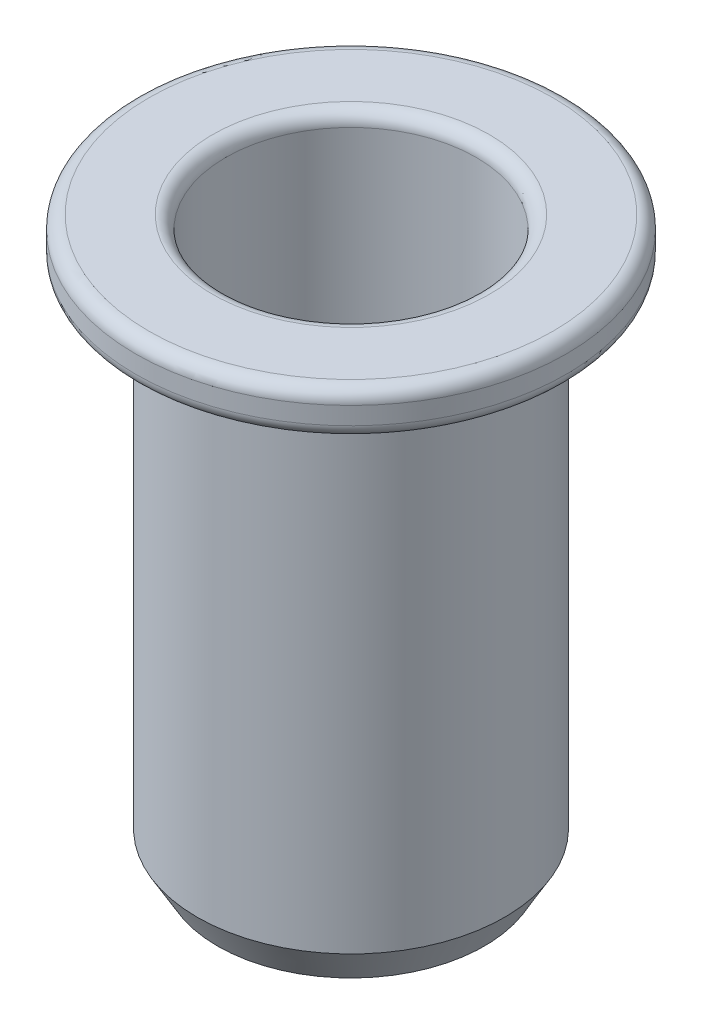
ISO-10303-21;
HEADER;
FILE_DESCRIPTION(('STEP AP214'),'2;1');
FILE_NAME('part.step','',(''),(''),'','','');
FILE_SCHEMA(('AUTOMOTIVE_DESIGN { 1 0 10303 214 1 1 1 1 }'));
ENDSEC;
DATA;
#1=APPLICATION_CONTEXT('core data for automotive mechanical design processes');
#2=APPLICATION_PROTOCOL_DEFINITION('international standard','automotive_design',2000,#1);
#3=PRODUCT_CONTEXT('',#1,'mechanical');
#4=PRODUCT('Part','Part','',(#3));
#5=PRODUCT_RELATED_PRODUCT_CATEGORY('part','',(#4));
#6=PRODUCT_DEFINITION_FORMATION('','',#4);
#7=PRODUCT_DEFINITION_CONTEXT('part definition',#1,'design');
#8=PRODUCT_DEFINITION('design','',#6,#7);
#9=PRODUCT_DEFINITION_SHAPE('','',#8);
#10=(LENGTH_UNIT() NAMED_UNIT(*) SI_UNIT(.MILLI.,.METRE.));
#11=(NAMED_UNIT(*) PLANE_ANGLE_UNIT() SI_UNIT($,.RADIAN.));
#12=(NAMED_UNIT(*) SI_UNIT($,.STERADIAN.) SOLID_ANGLE_UNIT());
#13=UNCERTAINTY_MEASURE_WITH_UNIT(LENGTH_MEASURE(1.E-05),#10,'distance_accuracy_value','');
#14=(GEOMETRIC_REPRESENTATION_CONTEXT(3) GLOBAL_UNCERTAINTY_ASSIGNED_CONTEXT((#13)) GLOBAL_UNIT_ASSIGNED_CONTEXT((#10,
#11,#12)) REPRESENTATION_CONTEXT('',''));
#15=CARTESIAN_POINT('',(0.,0.,0.));
#16=DIRECTION('',(0.,0.,1.));
#17=DIRECTION('',(1.,0.,0.));
#18=AXIS2_PLACEMENT_3D('',#15,#16,#17);
#19=CARTESIAN_POINT('',(0.,0.,0.));
#20=DIRECTION('',(0.,1.,0.));
#21=DIRECTION('',(0.,0.,1.));
#22=AXIS2_PLACEMENT_3D('',#19,#20,#21);
#23=CYLINDRICAL_SURFACE('',#22,2.85);
#24=CARTESIAN_POINT('',(0.,-0.3,0.));
#25=DIRECTION('',(0.,-1.,0.));
#26=DIRECTION('',(0.,0.,-1.));
#27=AXIS2_PLACEMENT_3D('',#24,#25,#26);
#28=CIRCLE('',#27,2.85);
#29=CARTESIAN_POINT('',(0.,-0.3,-2.85));
#30=VERTEX_POINT('',#29);
#31=EDGE_CURVE('E51',#30,#30,#28,.F.);
#32=ORIENTED_EDGE('',*,*,#31,.T.);
#33=EDGE_LOOP('',(#32));
#34=FACE_BOUND('',#33,.T.);
#35=CARTESIAN_POINT('',(0.,-5.7,0.));
#36=DIRECTION('',(0.,1.,0.));
#37=DIRECTION('',(0.,0.,1.));
#38=AXIS2_PLACEMENT_3D('',#35,#36,#37);
#39=CIRCLE('',#38,2.85);
#40=CARTESIAN_POINT('',(0.,-5.7,2.85));
#41=VERTEX_POINT('',#40);
#42=EDGE_CURVE('E75',#41,#41,#39,.T.);
#43=ORIENTED_EDGE('',*,*,#42,.F.);
#44=EDGE_LOOP('',(#43));
#45=FACE_BOUND('',#44,.T.);
#46=ADVANCED_FACE('F31',(#34,#45),#23,.F.);
#47=CARTESIAN_POINT('',(2.85,0.,0.));
#48=DIRECTION('',(0.,-1.,0.));
#49=DIRECTION('',(0.,0.,-1.));
#50=AXIS2_PLACEMENT_3D('',#47,#48,#49);
#51=PLANE('',#50);
#52=CARTESIAN_POINT('',(0.,0.,0.));
#53=DIRECTION('',(0.,-1.,0.));
#54=DIRECTION('',(0.,0.,-1.));
#55=AXIS2_PLACEMENT_3D('',#52,#53,#54);
#56=CIRCLE('',#55,4.6);
#57=CARTESIAN_POINT('',(0.,0.,-4.6));
#58=VERTEX_POINT('',#57);
#59=EDGE_CURVE('E54',#58,#58,#56,.F.);
#60=ORIENTED_EDGE('',*,*,#59,.T.);
#61=EDGE_LOOP('',(#60));
#62=FACE_BOUND('',#61,.T.);
#63=CARTESIAN_POINT('',(0.,0.,0.));
#64=DIRECTION('',(0.,-1.,0.));
#65=DIRECTION('',(0.,0.,-1.));
#66=AXIS2_PLACEMENT_3D('',#63,#64,#65);
#67=CIRCLE('',#66,3.15);
#68=CARTESIAN_POINT('',(0.,0.,-3.15));
#69=VERTEX_POINT('',#68);
#70=EDGE_CURVE('E57',#69,#69,#67,.T.);
#71=ORIENTED_EDGE('',*,*,#70,.T.);
#72=EDGE_LOOP('',(#71));
#73=FACE_BOUND('',#72,.T.);
#74=ADVANCED_FACE('F82',(#62,#73),#51,.F.);
#75=CARTESIAN_POINT('',(0.,0.,0.));
#76=DIRECTION('',(0.,1.,0.));
#77=DIRECTION('',(0.,0.,1.));
#78=AXIS2_PLACEMENT_3D('',#75,#76,#77);
#79=CYLINDRICAL_SURFACE('',#78,4.9);
#80=CARTESIAN_POINT('',(0.,-0.7,0.));
#81=DIRECTION('',(0.,1.,0.));
#82=DIRECTION('',(0.,0.,1.));
#83=AXIS2_PLACEMENT_3D('',#80,#81,#82);
#84=CIRCLE('',#83,4.9);
#85=CARTESIAN_POINT('',(0.,-0.7,4.9));
#86=VERTEX_POINT('',#85);
#87=EDGE_CURVE('E63',#86,#86,#84,.T.);
#88=ORIENTED_EDGE('',*,*,#87,.T.);
#89=EDGE_LOOP('',(#88));
#90=FACE_BOUND('',#89,.T.);
#91=CARTESIAN_POINT('',(0.,-0.3,0.));
#92=DIRECTION('',(0.,-1.,0.));
#93=DIRECTION('',(0.,0.,-1.));
#94=AXIS2_PLACEMENT_3D('',#91,#92,#93);
#95=CIRCLE('',#94,4.9);
#96=CARTESIAN_POINT('',(0.,-0.3,-4.9));
#97=VERTEX_POINT('',#96);
#98=EDGE_CURVE('E66',#97,#97,#95,.T.);
#99=ORIENTED_EDGE('',*,*,#98,.T.);
#100=EDGE_LOOP('',(#99));
#101=FACE_BOUND('',#100,.T.);
#102=ADVANCED_FACE('F88',(#90,#101),#79,.T.);
#103=CARTESIAN_POINT('',(4.9,-1.,0.));
#104=DIRECTION('',(0.,1.,0.));
#105=DIRECTION('',(0.,0.,1.));
#106=AXIS2_PLACEMENT_3D('',#103,#104,#105);
#107=PLANE('',#106);
#108=CARTESIAN_POINT('',(0.,-1.,0.));
#109=DIRECTION('',(0.,1.,0.));
#110=DIRECTION('',(0.,0.,1.));
#111=AXIS2_PLACEMENT_3D('',#108,#109,#110);
#112=CIRCLE('',#111,4.6);
#113=CARTESIAN_POINT('',(0.,-1.,4.6));
#114=VERTEX_POINT('',#113);
#115=EDGE_CURVE('E60',#114,#114,#112,.F.);
#116=ORIENTED_EDGE('',*,*,#115,.T.);
#117=EDGE_LOOP('',(#116));
#118=FACE_BOUND('',#117,.T.);
#119=CARTESIAN_POINT('',(0.,-1.,0.));
#120=DIRECTION('',(0.,1.,0.));
#121=DIRECTION('',(0.,0.,1.));
#122=AXIS2_PLACEMENT_3D('',#119,#120,#121);
#123=CIRCLE('',#122,3.5);
#124=CARTESIAN_POINT('',(0.,-1.,3.5));
#125=VERTEX_POINT('',#124);
#126=EDGE_CURVE('E69',#125,#125,#123,.T.);
#127=ORIENTED_EDGE('',*,*,#126,.T.);
#128=EDGE_LOOP('',(#127));
#129=FACE_BOUND('',#128,.T.);
#130=ADVANCED_FACE('F119',(#118,#129),#107,.F.);
#131=CARTESIAN_POINT('',(0.,0.,0.));
#132=DIRECTION('',(0.,1.,0.));
#133=DIRECTION('',(0.,0.,1.));
#134=AXIS2_PLACEMENT_3D('',#131,#132,#133);
#135=CYLINDRICAL_SURFACE('',#134,3.5);
#136=CARTESIAN_POINT('',(0.,-12.1,0.));
#137=DIRECTION('',(0.,1.,0.));
#138=DIRECTION('',(0.,0.,1.));
#139=AXIS2_PLACEMENT_3D('',#136,#137,#138);
#140=CIRCLE('',#139,3.5);
#141=CARTESIAN_POINT('',(0.,-12.1,3.5));
#142=VERTEX_POINT('',#141);
#143=EDGE_CURVE('E46',#142,#142,#140,.T.);
#144=ORIENTED_EDGE('',*,*,#143,.T.);
#145=EDGE_LOOP('',(#144));
#146=FACE_BOUND('',#145,.T.);
#147=ORIENTED_EDGE('',*,*,#126,.F.);
#148=EDGE_LOOP('',(#147));
#149=FACE_BOUND('',#148,.T.);
#150=ADVANCED_FACE('F115',(#146,#149),#135,.T.);
#151=CARTESIAN_POINT('',(3.5,-12.9,0.));
#152=DIRECTION('',(0.,1.,0.));
#153=DIRECTION('',(0.,0.,1.));
#154=AXIS2_PLACEMENT_3D('',#151,#152,#153);
#155=PLANE('',#154);
#156=CARTESIAN_POINT('',(0.,-12.9,0.));
#157=DIRECTION('',(0.,1.,0.));
#158=DIRECTION('',(0.,0.,1.));
#159=AXIS2_PLACEMENT_3D('',#156,#157,#158);
#160=CIRCLE('',#159,2.78867513459482);
#161=CARTESIAN_POINT('',(0.,-12.9,2.78867513459482));
#162=VERTEX_POINT('',#161);
#163=EDGE_CURVE('E38',#162,#162,#160,.T.);
#164=ORIENTED_EDGE('',*,*,#163,.T.);
#165=EDGE_LOOP('',(#164));
#166=FACE_BOUND('',#165,.T.);
#167=CARTESIAN_POINT('',(0.,-12.9,0.));
#168=DIRECTION('',(0.,1.,0.));
#169=DIRECTION('',(0.,0.,1.));
#170=AXIS2_PLACEMENT_3D('',#167,#168,#169);
#171=CIRCLE('',#170,3.03811978464831);
#172=CARTESIAN_POINT('',(0.,-12.9,3.03811978464831));
#173=VERTEX_POINT('',#172);
#174=EDGE_CURVE('E42',#173,#173,#171,.F.);
#175=ORIENTED_EDGE('',*,*,#174,.T.);
#176=EDGE_LOOP('',(#175));
#177=FACE_BOUND('',#176,.T.);
#178=ADVANCED_FACE('F118',(#166,#177),#155,.F.);
#179=CARTESIAN_POINT('',(0.,0.,0.));
#180=DIRECTION('',(0.,1.,0.));
#181=DIRECTION('',(0.,0.,1.));
#182=AXIS2_PLACEMENT_3D('',#179,#180,#181);
#183=CYLINDRICAL_SURFACE('',#182,2.5);
#184=CARTESIAN_POINT('',(0.,-12.4,0.));
#185=DIRECTION('',(0.,1.,0.));
#186=DIRECTION('',(0.,0.,1.));
#187=AXIS2_PLACEMENT_3D('',#184,#185,#186);
#188=CIRCLE('',#187,2.5);
#189=CARTESIAN_POINT('',(0.,-12.4,2.5));
#190=VERTEX_POINT('',#189);
#191=EDGE_CURVE('E10',#190,#190,#188,.F.);
#192=ORIENTED_EDGE('',*,*,#191,.T.);
#193=EDGE_LOOP('',(#192));
#194=FACE_BOUND('',#193,.T.);
#195=CARTESIAN_POINT('',(0.,-5.7,0.));
#196=DIRECTION('',(0.,1.,0.));
#197=DIRECTION('',(0.,0.,1.));
#198=AXIS2_PLACEMENT_3D('',#195,#196,#197);
#199=CIRCLE('',#198,2.5);
#200=CARTESIAN_POINT('',(0.,-5.7,2.5));
#201=VERTEX_POINT('',#200);
#202=EDGE_CURVE('E72',#201,#201,#199,.T.);
#203=ORIENTED_EDGE('',*,*,#202,.T.);
#204=EDGE_LOOP('',(#203));
#205=FACE_BOUND('',#204,.T.);
#206=ADVANCED_FACE('F133',(#194,#205),#183,.F.);
#207=CARTESIAN_POINT('',(2.5,-5.7,0.));
#208=DIRECTION('',(0.,-1.,0.));
#209=DIRECTION('',(0.,0.,-1.));
#210=AXIS2_PLACEMENT_3D('',#207,#208,#209);
#211=PLANE('',#210);
#212=ORIENTED_EDGE('',*,*,#202,.F.);
#213=EDGE_LOOP('',(#212));
#214=FACE_BOUND('',#213,.T.);
#215=ORIENTED_EDGE('',*,*,#42,.T.);
#216=EDGE_LOOP('',(#215));
#217=FACE_BOUND('',#216,.T.);
#218=ADVANCED_FACE('F79',(#214,#217),#211,.F.);
#219=CARTESIAN_POINT('',(0.,-0.7,0.));
#220=DIRECTION('',(0.,1.,0.));
#221=DIRECTION('',(0.,0.,1.));
#222=AXIS2_PLACEMENT_3D('',#219,#220,#221);
#223=TOROIDAL_SURFACE('',#222,4.6,0.3);
#224=ORIENTED_EDGE('',*,*,#115,.F.);
#225=EDGE_LOOP('',(#224));
#226=FACE_BOUND('',#225,.T.);
#227=ORIENTED_EDGE('',*,*,#87,.F.);
#228=EDGE_LOOP('',(#227));
#229=FACE_BOUND('',#228,.T.);
#230=ADVANCED_FACE('F93',(#226,#229),#223,.T.);
#231=CARTESIAN_POINT('',(0.,-0.3,0.));
#232=DIRECTION('',(0.,-1.,0.));
#233=DIRECTION('',(0.,0.,-1.));
#234=AXIS2_PLACEMENT_3D('',#231,#232,#233);
#235=TOROIDAL_SURFACE('',#234,4.6,0.3);
#236=ORIENTED_EDGE('',*,*,#98,.F.);
#237=EDGE_LOOP('',(#236));
#238=FACE_BOUND('',#237,.T.);
#239=ORIENTED_EDGE('',*,*,#59,.F.);
#240=EDGE_LOOP('',(#239));
#241=FACE_BOUND('',#240,.T.);
#242=ADVANCED_FACE('F96',(#238,#241),#235,.T.);
#243=CARTESIAN_POINT('',(0.,-0.3,0.));
#244=DIRECTION('',(0.,-1.,0.));
#245=DIRECTION('',(0.,0.,-1.));
#246=AXIS2_PLACEMENT_3D('',#243,#244,#245);
#247=TOROIDAL_SURFACE('',#246,3.15,0.3);
#248=ORIENTED_EDGE('',*,*,#70,.F.);
#249=EDGE_LOOP('',(#248));
#250=FACE_BOUND('',#249,.T.);
#251=ORIENTED_EDGE('',*,*,#31,.F.);
#252=EDGE_LOOP('',(#251));
#253=FACE_BOUND('',#252,.T.);
#254=ADVANCED_FACE('F100',(#250,#253),#247,.T.);
#255=CARTESIAN_POINT('',(0.,-12.1,0.));
#256=DIRECTION('',(0.,1.,0.));
#257=DIRECTION('',(0.,0.,1.));
#258=AXIS2_PLACEMENT_3D('',#255,#256,#257);
#259=CONICAL_SURFACE('',#258,3.5,0.523598775598295);
#260=ORIENTED_EDGE('',*,*,#174,.F.);
#261=EDGE_LOOP('',(#260));
#262=FACE_BOUND('',#261,.T.);
#263=ORIENTED_EDGE('',*,*,#143,.F.);
#264=EDGE_LOOP('',(#263));
#265=FACE_BOUND('',#264,.T.);
#266=ADVANCED_FACE('F103',(#262,#265),#259,.T.);
#267=CARTESIAN_POINT('',(0.,-12.9,0.));
#268=DIRECTION('',(0.,-1.,0.));
#269=DIRECTION('',(0.,0.,-1.));
#270=AXIS2_PLACEMENT_3D('',#267,#268,#269);
#271=CONICAL_SURFACE('',#270,2.78867513459482,0.523598775598298);
#272=ORIENTED_EDGE('',*,*,#191,.F.);
#273=EDGE_LOOP('',(#272));
#274=FACE_BOUND('',#273,.T.);
#275=ORIENTED_EDGE('',*,*,#163,.F.);
#276=EDGE_LOOP('',(#275));
#277=FACE_BOUND('',#276,.T.);
#278=ADVANCED_FACE('F33',(#274,#277),#271,.F.);
#279=CLOSED_SHELL('',(#46,#74,#102,#130,#150,#178,#206,#218,#230,#242,#254,#266,#278));
#280=MANIFOLD_SOLID_BREP('B2',#279);
#281=ADVANCED_BREP_SHAPE_REPRESENTATION('',(#18,#280),#14);
#282=SHAPE_DEFINITION_REPRESENTATION(#9,#281);
ENDSEC;
END-ISO-10303-21;
